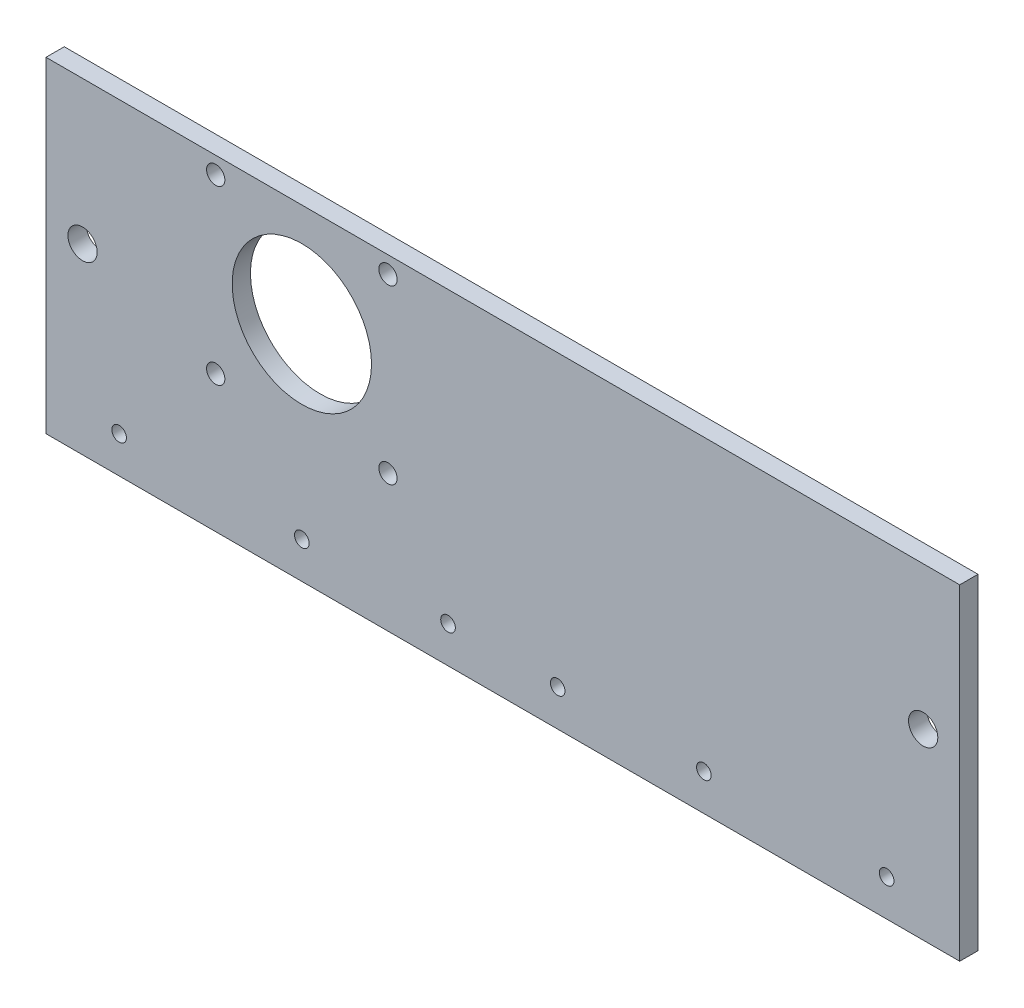
ISO-10303-21;
HEADER;
FILE_DESCRIPTION(('STEP AP214'),'2;1');
FILE_NAME('part.step','',(''),(''),'','','');
FILE_SCHEMA(('AUTOMOTIVE_DESIGN { 1 0 10303 214 1 1 1 1 }'));
ENDSEC;
DATA;
#1=APPLICATION_CONTEXT('core data for automotive mechanical design processes');
#2=APPLICATION_PROTOCOL_DEFINITION('international standard','automotive_design',2000,#1);
#3=PRODUCT_CONTEXT('',#1,'mechanical');
#4=PRODUCT('Part','Part','',(#3));
#5=PRODUCT_RELATED_PRODUCT_CATEGORY('part','',(#4));
#6=PRODUCT_DEFINITION_FORMATION('','',#4);
#7=PRODUCT_DEFINITION_CONTEXT('part definition',#1,'design');
#8=PRODUCT_DEFINITION('design','',#6,#7);
#9=PRODUCT_DEFINITION_SHAPE('','',#8);
#10=(LENGTH_UNIT() NAMED_UNIT(*) SI_UNIT(.MILLI.,.METRE.));
#11=(NAMED_UNIT(*) PLANE_ANGLE_UNIT() SI_UNIT($,.RADIAN.));
#12=(NAMED_UNIT(*) SI_UNIT($,.STERADIAN.) SOLID_ANGLE_UNIT());
#13=UNCERTAINTY_MEASURE_WITH_UNIT(LENGTH_MEASURE(1.E-05),#10,'distance_accuracy_value','');
#14=(GEOMETRIC_REPRESENTATION_CONTEXT(3) GLOBAL_UNCERTAINTY_ASSIGNED_CONTEXT((#13)) GLOBAL_UNIT_ASSIGNED_CONTEXT((#10,
#11,#12)) REPRESENTATION_CONTEXT('',''));
#15=CARTESIAN_POINT('',(0.,0.,0.));
#16=DIRECTION('',(0.,0.,1.));
#17=DIRECTION('',(1.,0.,0.));
#18=AXIS2_PLACEMENT_3D('',#15,#16,#17);
#19=CARTESIAN_POINT('',(0.,0.,5.));
#20=DIRECTION('',(1.,0.,0.));
#21=DIRECTION('',(0.,0.,-1.));
#22=AXIS2_PLACEMENT_3D('',#19,#20,#21);
#23=PLANE('',#22);
#24=DIRECTION('',(0.,-1.,0.));
#25=VECTOR('',#24,1.);
#26=CARTESIAN_POINT('',(0.,0.,0.));
#27=LINE('',#26,#25);
#28=CARTESIAN_POINT('',(0.,89.2,0.));
#29=VERTEX_POINT('',#28);
#30=CARTESIAN_POINT('',(0.,0.,0.));
#31=VERTEX_POINT('',#30);
#32=EDGE_CURVE('E99',#29,#31,#27,.T.);
#33=ORIENTED_EDGE('',*,*,#32,.T.);
#34=DIRECTION('',(0.,0.,-1.));
#35=VECTOR('',#34,1.);
#36=CARTESIAN_POINT('',(0.,0.,5.));
#37=LINE('',#36,#35);
#38=CARTESIAN_POINT('',(0.,0.,5.));
#39=VERTEX_POINT('',#38);
#40=EDGE_CURVE('E11',#39,#31,#37,.T.);
#41=ORIENTED_EDGE('',*,*,#40,.F.);
#42=DIRECTION('',(0.,-1.,0.));
#43=VECTOR('',#42,1.);
#44=CARTESIAN_POINT('',(0.,0.,5.));
#45=LINE('',#44,#43);
#46=CARTESIAN_POINT('',(0.,89.2,5.));
#47=VERTEX_POINT('',#46);
#48=EDGE_CURVE('E86',#47,#39,#45,.T.);
#49=ORIENTED_EDGE('',*,*,#48,.F.);
#50=DIRECTION('',(0.,0.,-1.));
#51=VECTOR('',#50,1.);
#52=CARTESIAN_POINT('',(0.,89.2,5.));
#53=LINE('',#52,#51);
#54=EDGE_CURVE('E95',#47,#29,#53,.T.);
#55=ORIENTED_EDGE('',*,*,#54,.T.);
#56=EDGE_LOOP('',(#33,#41,#49,#55));
#57=FACE_BOUND('',#56,.T.);
#58=ADVANCED_FACE('F33',(#57),#23,.F.);
#59=CARTESIAN_POINT('',(0.,0.,5.));
#60=DIRECTION('',(0.,1.,0.));
#61=DIRECTION('',(0.,0.,1.));
#62=AXIS2_PLACEMENT_3D('',#59,#60,#61);
#63=PLANE('',#62);
#64=DIRECTION('',(1.,0.,0.));
#65=VECTOR('',#64,1.);
#66=CARTESIAN_POINT('',(0.,0.,0.));
#67=LINE('',#66,#65);
#68=CARTESIAN_POINT('',(250.,0.,0.));
#69=VERTEX_POINT('',#68);
#70=EDGE_CURVE('E90',#31,#69,#67,.T.);
#71=ORIENTED_EDGE('',*,*,#70,.T.);
#72=DIRECTION('',(0.,0.,-1.));
#73=VECTOR('',#72,1.);
#74=CARTESIAN_POINT('',(250.,0.,5.));
#75=LINE('',#74,#73);
#76=CARTESIAN_POINT('',(250.,0.,5.));
#77=VERTEX_POINT('',#76);
#78=EDGE_CURVE('E42',#77,#69,#75,.T.);
#79=ORIENTED_EDGE('',*,*,#78,.F.);
#80=DIRECTION('',(1.,0.,0.));
#81=VECTOR('',#80,1.);
#82=CARTESIAN_POINT('',(0.,0.,5.));
#83=LINE('',#82,#81);
#84=EDGE_CURVE('E81',#39,#77,#83,.T.);
#85=ORIENTED_EDGE('',*,*,#84,.F.);
#86=ORIENTED_EDGE('',*,*,#40,.T.);
#87=EDGE_LOOP('',(#71,#79,#85,#86));
#88=FACE_BOUND('',#87,.T.);
#89=ADVANCED_FACE('F89',(#88),#63,.F.);
#90=CARTESIAN_POINT('',(250.,0.,5.));
#91=DIRECTION('',(-1.,0.,0.));
#92=DIRECTION('',(0.,0.,1.));
#93=AXIS2_PLACEMENT_3D('',#90,#91,#92);
#94=PLANE('',#93);
#95=DIRECTION('',(0.,1.,0.));
#96=VECTOR('',#95,1.);
#97=CARTESIAN_POINT('',(250.,0.,0.));
#98=LINE('',#97,#96);
#99=CARTESIAN_POINT('',(250.,89.2,0.));
#100=VERTEX_POINT('',#99);
#101=EDGE_CURVE('E68',#69,#100,#98,.T.);
#102=ORIENTED_EDGE('',*,*,#101,.T.);
#103=DIRECTION('',(0.,0.,-1.));
#104=VECTOR('',#103,1.);
#105=CARTESIAN_POINT('',(250.,89.2,5.));
#106=LINE('',#105,#104);
#107=CARTESIAN_POINT('',(250.,89.2,5.));
#108=VERTEX_POINT('',#107);
#109=EDGE_CURVE('E91',#108,#100,#106,.T.);
#110=ORIENTED_EDGE('',*,*,#109,.F.);
#111=DIRECTION('',(0.,1.,0.));
#112=VECTOR('',#111,1.);
#113=CARTESIAN_POINT('',(250.,0.,5.));
#114=LINE('',#113,#112);
#115=EDGE_CURVE('E84',#77,#108,#114,.T.);
#116=ORIENTED_EDGE('',*,*,#115,.F.);
#117=ORIENTED_EDGE('',*,*,#78,.T.);
#118=EDGE_LOOP('',(#102,#110,#116,#117));
#119=FACE_BOUND('',#118,.T.);
#120=ADVANCED_FACE('F93',(#119),#94,.F.);
#121=CARTESIAN_POINT('',(0.,89.2,5.));
#122=DIRECTION('',(0.,-1.,0.));
#123=DIRECTION('',(0.,0.,-1.));
#124=AXIS2_PLACEMENT_3D('',#121,#122,#123);
#125=PLANE('',#124);
#126=DIRECTION('',(-1.,0.,0.));
#127=VECTOR('',#126,1.);
#128=CARTESIAN_POINT('',(0.,89.2,0.));
#129=LINE('',#128,#127);
#130=EDGE_CURVE('E74',#100,#29,#129,.T.);
#131=ORIENTED_EDGE('',*,*,#130,.T.);
#132=ORIENTED_EDGE('',*,*,#54,.F.);
#133=DIRECTION('',(-1.,0.,0.));
#134=VECTOR('',#133,1.);
#135=CARTESIAN_POINT('',(0.,89.2,5.));
#136=LINE('',#135,#134);
#137=EDGE_CURVE('E51',#108,#47,#136,.T.);
#138=ORIENTED_EDGE('',*,*,#137,.F.);
#139=ORIENTED_EDGE('',*,*,#109,.T.);
#140=EDGE_LOOP('',(#131,#132,#138,#139));
#141=FACE_BOUND('',#140,.T.);
#142=ADVANCED_FACE('F190',(#141),#125,.F.);
#143=CARTESIAN_POINT('',(0.,0.,5.));
#144=DIRECTION('',(0.,0.,-1.));
#145=DIRECTION('',(-1.,0.,0.));
#146=AXIS2_PLACEMENT_3D('',#143,#144,#145);
#147=PLANE('',#146);
#148=CARTESIAN_POINT('',(70.,61.,5.));
#149=DIRECTION('',(0.,0.,1.));
#150=DIRECTION('',(1.,0.,0.));
#151=AXIS2_PLACEMENT_3D('',#148,#149,#150);
#152=CIRCLE('',#151,19.0625);
#153=CARTESIAN_POINT('',(89.0625,61.,5.));
#154=VERTEX_POINT('',#153);
#155=EDGE_CURVE('E162',#154,#154,#152,.T.);
#156=ORIENTED_EDGE('',*,*,#155,.F.);
#157=EDGE_LOOP('',(#156));
#158=FACE_BOUND('',#157,.T.);
#159=CARTESIAN_POINT('',(93.57,37.43,5.));
#160=DIRECTION('',(0.,0.,1.));
#161=DIRECTION('',(1.,0.,0.));
#162=AXIS2_PLACEMENT_3D('',#159,#160,#161);
#163=CIRCLE('',#162,2.5);
#164=CARTESIAN_POINT('',(96.07,37.43,5.));
#165=VERTEX_POINT('',#164);
#166=EDGE_CURVE('E152',#165,#165,#163,.T.);
#167=ORIENTED_EDGE('',*,*,#166,.F.);
#168=EDGE_LOOP('',(#167));
#169=FACE_BOUND('',#168,.T.);
#170=CARTESIAN_POINT('',(46.43,37.43,5.));
#171=DIRECTION('',(0.,0.,1.));
#172=DIRECTION('',(1.,0.,0.));
#173=AXIS2_PLACEMENT_3D('',#170,#171,#172);
#174=CIRCLE('',#173,2.5);
#175=CARTESIAN_POINT('',(48.93,37.43,5.));
#176=VERTEX_POINT('',#175);
#177=EDGE_CURVE('E149',#176,#176,#174,.T.);
#178=ORIENTED_EDGE('',*,*,#177,.F.);
#179=EDGE_LOOP('',(#178));
#180=FACE_BOUND('',#179,.T.);
#181=CARTESIAN_POINT('',(46.43,84.57,5.));
#182=DIRECTION('',(0.,0.,1.));
#183=DIRECTION('',(1.,0.,0.));
#184=AXIS2_PLACEMENT_3D('',#181,#182,#183);
#185=CIRCLE('',#184,2.5);
#186=CARTESIAN_POINT('',(48.93,84.57,5.));
#187=VERTEX_POINT('',#186);
#188=EDGE_CURVE('E146',#187,#187,#185,.T.);
#189=ORIENTED_EDGE('',*,*,#188,.F.);
#190=EDGE_LOOP('',(#189));
#191=FACE_BOUND('',#190,.T.);
#192=CARTESIAN_POINT('',(93.57,84.57,5.));
#193=DIRECTION('',(0.,0.,1.));
#194=DIRECTION('',(1.,0.,0.));
#195=AXIS2_PLACEMENT_3D('',#192,#193,#194);
#196=CIRCLE('',#195,2.5);
#197=CARTESIAN_POINT('',(96.07,84.57,5.));
#198=VERTEX_POINT('',#197);
#199=EDGE_CURVE('E142',#198,#198,#196,.T.);
#200=ORIENTED_EDGE('',*,*,#199,.F.);
#201=EDGE_LOOP('',(#200));
#202=FACE_BOUND('',#201,.T.);
#203=CARTESIAN_POINT('',(10.,50.,5.));
#204=DIRECTION('',(0.,0.,1.));
#205=DIRECTION('',(1.,0.,0.));
#206=AXIS2_PLACEMENT_3D('',#203,#204,#205);
#207=CIRCLE('',#206,4.);
#208=CARTESIAN_POINT('',(14.,50.,5.));
#209=VERTEX_POINT('',#208);
#210=EDGE_CURVE('E138',#209,#209,#207,.T.);
#211=ORIENTED_EDGE('',*,*,#210,.F.);
#212=EDGE_LOOP('',(#211));
#213=FACE_BOUND('',#212,.T.);
#214=CARTESIAN_POINT('',(240.,50.,5.));
#215=DIRECTION('',(0.,0.,1.));
#216=DIRECTION('',(1.,0.,0.));
#217=AXIS2_PLACEMENT_3D('',#214,#215,#216);
#218=CIRCLE('',#217,3.99999999999999);
#219=CARTESIAN_POINT('',(244.,50.,5.));
#220=VERTEX_POINT('',#219);
#221=EDGE_CURVE('E134',#220,#220,#218,.T.);
#222=ORIENTED_EDGE('',*,*,#221,.F.);
#223=EDGE_LOOP('',(#222));
#224=FACE_BOUND('',#223,.T.);
#225=CARTESIAN_POINT('',(230.,10.,5.));
#226=DIRECTION('',(0.,0.,1.));
#227=DIRECTION('',(1.,0.,0.));
#228=AXIS2_PLACEMENT_3D('',#225,#226,#227);
#229=CIRCLE('',#228,2.);
#230=CARTESIAN_POINT('',(232.,10.,5.));
#231=VERTEX_POINT('',#230);
#232=EDGE_CURVE('E130',#231,#231,#229,.T.);
#233=ORIENTED_EDGE('',*,*,#232,.F.);
#234=EDGE_LOOP('',(#233));
#235=FACE_BOUND('',#234,.T.);
#236=CARTESIAN_POINT('',(180.,10.,5.));
#237=DIRECTION('',(0.,0.,1.));
#238=DIRECTION('',(1.,0.,0.));
#239=AXIS2_PLACEMENT_3D('',#236,#237,#238);
#240=CIRCLE('',#239,2.);
#241=CARTESIAN_POINT('',(182.,10.,5.));
#242=VERTEX_POINT('',#241);
#243=EDGE_CURVE('E126',#242,#242,#240,.T.);
#244=ORIENTED_EDGE('',*,*,#243,.F.);
#245=EDGE_LOOP('',(#244));
#246=FACE_BOUND('',#245,.T.);
#247=CARTESIAN_POINT('',(140.,10.,5.));
#248=DIRECTION('',(0.,0.,1.));
#249=DIRECTION('',(1.,0.,0.));
#250=AXIS2_PLACEMENT_3D('',#247,#248,#249);
#251=CIRCLE('',#250,2.);
#252=CARTESIAN_POINT('',(142.,10.,5.));
#253=VERTEX_POINT('',#252);
#254=EDGE_CURVE('E122',#253,#253,#251,.T.);
#255=ORIENTED_EDGE('',*,*,#254,.F.);
#256=EDGE_LOOP('',(#255));
#257=FACE_BOUND('',#256,.T.);
#258=CARTESIAN_POINT('',(110.,9.99999999999999,5.));
#259=DIRECTION('',(0.,0.,1.));
#260=DIRECTION('',(1.,0.,0.));
#261=AXIS2_PLACEMENT_3D('',#258,#259,#260);
#262=CIRCLE('',#261,2.);
#263=CARTESIAN_POINT('',(112.,9.99999999999999,5.));
#264=VERTEX_POINT('',#263);
#265=EDGE_CURVE('E118',#264,#264,#262,.T.);
#266=ORIENTED_EDGE('',*,*,#265,.F.);
#267=EDGE_LOOP('',(#266));
#268=FACE_BOUND('',#267,.T.);
#269=CARTESIAN_POINT('',(70.,9.99999999999999,5.));
#270=DIRECTION('',(0.,0.,1.));
#271=DIRECTION('',(1.,0.,0.));
#272=AXIS2_PLACEMENT_3D('',#269,#270,#271);
#273=CIRCLE('',#272,2.);
#274=CARTESIAN_POINT('',(72.,9.99999999999999,5.));
#275=VERTEX_POINT('',#274);
#276=EDGE_CURVE('E114',#275,#275,#273,.T.);
#277=ORIENTED_EDGE('',*,*,#276,.F.);
#278=EDGE_LOOP('',(#277));
#279=FACE_BOUND('',#278,.T.);
#280=CARTESIAN_POINT('',(20.,10.,5.));
#281=DIRECTION('',(0.,0.,1.));
#282=DIRECTION('',(1.,0.,0.));
#283=AXIS2_PLACEMENT_3D('',#280,#281,#282);
#284=CIRCLE('',#283,2.);
#285=CARTESIAN_POINT('',(22.,10.,5.));
#286=VERTEX_POINT('',#285);
#287=EDGE_CURVE('E110',#286,#286,#284,.T.);
#288=ORIENTED_EDGE('',*,*,#287,.F.);
#289=EDGE_LOOP('',(#288));
#290=FACE_BOUND('',#289,.T.);
#291=ORIENTED_EDGE('',*,*,#48,.T.);
#292=ORIENTED_EDGE('',*,*,#84,.T.);
#293=ORIENTED_EDGE('',*,*,#115,.T.);
#294=ORIENTED_EDGE('',*,*,#137,.T.);
#295=EDGE_LOOP('',(#291,#292,#293,#294));
#296=FACE_BOUND('',#295,.T.);
#297=ADVANCED_FACE('F82',(#158,#169,#180,#191,#202,#213,#224,#235,#246,#257,#268,#279,#290,
#296),#147,.F.);
#298=CARTESIAN_POINT('',(0.,0.,0.));
#299=DIRECTION('',(0.,0.,-1.));
#300=DIRECTION('',(-1.,0.,0.));
#301=AXIS2_PLACEMENT_3D('',#298,#299,#300);
#302=PLANE('',#301);
#303=CARTESIAN_POINT('',(70.,61.,0.));
#304=DIRECTION('',(0.,0.,-1.));
#305=DIRECTION('',(-1.,0.,0.));
#306=AXIS2_PLACEMENT_3D('',#303,#304,#305);
#307=CIRCLE('',#306,19.0625);
#308=CARTESIAN_POINT('',(50.9375,61.,0.));
#309=VERTEX_POINT('',#308);
#310=EDGE_CURVE('E36',#309,#309,#307,.T.);
#311=ORIENTED_EDGE('',*,*,#310,.F.);
#312=EDGE_LOOP('',(#311));
#313=FACE_BOUND('',#312,.T.);
#314=CARTESIAN_POINT('',(93.57,37.43,0.));
#315=DIRECTION('',(0.,0.,-1.));
#316=DIRECTION('',(-1.,0.,0.));
#317=AXIS2_PLACEMENT_3D('',#314,#315,#316);
#318=CIRCLE('',#317,2.5);
#319=CARTESIAN_POINT('',(91.07,37.43,0.));
#320=VERTEX_POINT('',#319);
#321=EDGE_CURVE('E150',#320,#320,#318,.T.);
#322=ORIENTED_EDGE('',*,*,#321,.F.);
#323=EDGE_LOOP('',(#322));
#324=FACE_BOUND('',#323,.T.);
#325=CARTESIAN_POINT('',(46.43,37.43,0.));
#326=DIRECTION('',(0.,0.,-1.));
#327=DIRECTION('',(-1.,0.,0.));
#328=AXIS2_PLACEMENT_3D('',#325,#326,#327);
#329=CIRCLE('',#328,2.5);
#330=CARTESIAN_POINT('',(43.93,37.43,0.));
#331=VERTEX_POINT('',#330);
#332=EDGE_CURVE('E147',#331,#331,#329,.T.);
#333=ORIENTED_EDGE('',*,*,#332,.F.);
#334=EDGE_LOOP('',(#333));
#335=FACE_BOUND('',#334,.T.);
#336=CARTESIAN_POINT('',(46.43,84.57,0.));
#337=DIRECTION('',(0.,0.,-1.));
#338=DIRECTION('',(-1.,0.,0.));
#339=AXIS2_PLACEMENT_3D('',#336,#337,#338);
#340=CIRCLE('',#339,2.5);
#341=CARTESIAN_POINT('',(43.93,84.57,0.));
#342=VERTEX_POINT('',#341);
#343=EDGE_CURVE('E143',#342,#342,#340,.T.);
#344=ORIENTED_EDGE('',*,*,#343,.F.);
#345=EDGE_LOOP('',(#344));
#346=FACE_BOUND('',#345,.T.);
#347=CARTESIAN_POINT('',(93.57,84.57,0.));
#348=DIRECTION('',(0.,0.,-1.));
#349=DIRECTION('',(-1.,0.,0.));
#350=AXIS2_PLACEMENT_3D('',#347,#348,#349);
#351=CIRCLE('',#350,2.5);
#352=CARTESIAN_POINT('',(91.07,84.57,0.));
#353=VERTEX_POINT('',#352);
#354=EDGE_CURVE('E139',#353,#353,#351,.T.);
#355=ORIENTED_EDGE('',*,*,#354,.F.);
#356=EDGE_LOOP('',(#355));
#357=FACE_BOUND('',#356,.T.);
#358=CARTESIAN_POINT('',(10.,50.,0.));
#359=DIRECTION('',(0.,0.,-1.));
#360=DIRECTION('',(-1.,0.,0.));
#361=AXIS2_PLACEMENT_3D('',#358,#359,#360);
#362=CIRCLE('',#361,4.);
#363=CARTESIAN_POINT('',(6.,50.,0.));
#364=VERTEX_POINT('',#363);
#365=EDGE_CURVE('E135',#364,#364,#362,.T.);
#366=ORIENTED_EDGE('',*,*,#365,.F.);
#367=EDGE_LOOP('',(#366));
#368=FACE_BOUND('',#367,.T.);
#369=CARTESIAN_POINT('',(240.,50.,0.));
#370=DIRECTION('',(0.,0.,-1.));
#371=DIRECTION('',(-1.,0.,0.));
#372=AXIS2_PLACEMENT_3D('',#369,#370,#371);
#373=CIRCLE('',#372,3.99999999999999);
#374=CARTESIAN_POINT('',(236.,50.,0.));
#375=VERTEX_POINT('',#374);
#376=EDGE_CURVE('E131',#375,#375,#373,.T.);
#377=ORIENTED_EDGE('',*,*,#376,.F.);
#378=EDGE_LOOP('',(#377));
#379=FACE_BOUND('',#378,.T.);
#380=CARTESIAN_POINT('',(230.,10.,0.));
#381=DIRECTION('',(0.,0.,-1.));
#382=DIRECTION('',(-1.,0.,0.));
#383=AXIS2_PLACEMENT_3D('',#380,#381,#382);
#384=CIRCLE('',#383,2.);
#385=CARTESIAN_POINT('',(228.,10.,0.));
#386=VERTEX_POINT('',#385);
#387=EDGE_CURVE('E127',#386,#386,#384,.T.);
#388=ORIENTED_EDGE('',*,*,#387,.F.);
#389=EDGE_LOOP('',(#388));
#390=FACE_BOUND('',#389,.T.);
#391=CARTESIAN_POINT('',(180.,10.,0.));
#392=DIRECTION('',(0.,0.,-1.));
#393=DIRECTION('',(-1.,0.,0.));
#394=AXIS2_PLACEMENT_3D('',#391,#392,#393);
#395=CIRCLE('',#394,2.);
#396=CARTESIAN_POINT('',(178.,10.,0.));
#397=VERTEX_POINT('',#396);
#398=EDGE_CURVE('E123',#397,#397,#395,.T.);
#399=ORIENTED_EDGE('',*,*,#398,.F.);
#400=EDGE_LOOP('',(#399));
#401=FACE_BOUND('',#400,.T.);
#402=CARTESIAN_POINT('',(140.,10.,0.));
#403=DIRECTION('',(0.,0.,-1.));
#404=DIRECTION('',(-1.,0.,0.));
#405=AXIS2_PLACEMENT_3D('',#402,#403,#404);
#406=CIRCLE('',#405,2.);
#407=CARTESIAN_POINT('',(138.,10.,0.));
#408=VERTEX_POINT('',#407);
#409=EDGE_CURVE('E119',#408,#408,#406,.T.);
#410=ORIENTED_EDGE('',*,*,#409,.F.);
#411=EDGE_LOOP('',(#410));
#412=FACE_BOUND('',#411,.T.);
#413=CARTESIAN_POINT('',(110.,9.99999999999999,0.));
#414=DIRECTION('',(0.,0.,-1.));
#415=DIRECTION('',(-1.,0.,0.));
#416=AXIS2_PLACEMENT_3D('',#413,#414,#415);
#417=CIRCLE('',#416,2.);
#418=CARTESIAN_POINT('',(108.,9.99999999999999,0.));
#419=VERTEX_POINT('',#418);
#420=EDGE_CURVE('E115',#419,#419,#417,.T.);
#421=ORIENTED_EDGE('',*,*,#420,.F.);
#422=EDGE_LOOP('',(#421));
#423=FACE_BOUND('',#422,.T.);
#424=CARTESIAN_POINT('',(70.,9.99999999999999,0.));
#425=DIRECTION('',(0.,0.,-1.));
#426=DIRECTION('',(-1.,0.,0.));
#427=AXIS2_PLACEMENT_3D('',#424,#425,#426);
#428=CIRCLE('',#427,2.);
#429=CARTESIAN_POINT('',(68.,9.99999999999999,0.));
#430=VERTEX_POINT('',#429);
#431=EDGE_CURVE('E111',#430,#430,#428,.T.);
#432=ORIENTED_EDGE('',*,*,#431,.F.);
#433=EDGE_LOOP('',(#432));
#434=FACE_BOUND('',#433,.T.);
#435=CARTESIAN_POINT('',(20.,10.,0.));
#436=DIRECTION('',(0.,0.,-1.));
#437=DIRECTION('',(-1.,0.,0.));
#438=AXIS2_PLACEMENT_3D('',#435,#436,#437);
#439=CIRCLE('',#438,2.);
#440=CARTESIAN_POINT('',(18.,10.,0.));
#441=VERTEX_POINT('',#440);
#442=EDGE_CURVE('E102',#441,#441,#439,.T.);
#443=ORIENTED_EDGE('',*,*,#442,.F.);
#444=EDGE_LOOP('',(#443));
#445=FACE_BOUND('',#444,.T.);
#446=ORIENTED_EDGE('',*,*,#32,.F.);
#447=ORIENTED_EDGE('',*,*,#130,.F.);
#448=ORIENTED_EDGE('',*,*,#101,.F.);
#449=ORIENTED_EDGE('',*,*,#70,.F.);
#450=EDGE_LOOP('',(#446,#447,#448,#449));
#451=FACE_BOUND('',#450,.T.);
#452=ADVANCED_FACE('F189',(#313,#324,#335,#346,#357,#368,#379,#390,#401,#412,#423,#434,#445,
#451),#302,.T.);
#453=CARTESIAN_POINT('',(20.,10.,-22.));
#454=DIRECTION('',(0.,0.,1.));
#455=DIRECTION('',(1.,0.,0.));
#456=AXIS2_PLACEMENT_3D('',#453,#454,#455);
#457=CYLINDRICAL_SURFACE('',#456,2.);
#458=ORIENTED_EDGE('',*,*,#442,.T.);
#459=EDGE_LOOP('',(#458));
#460=FACE_BOUND('',#459,.T.);
#461=ORIENTED_EDGE('',*,*,#287,.T.);
#462=EDGE_LOOP('',(#461));
#463=FACE_BOUND('',#462,.T.);
#464=ADVANCED_FACE('F186',(#460,#463),#457,.F.);
#465=CARTESIAN_POINT('',(70.,9.99999999999999,-22.));
#466=DIRECTION('',(0.,0.,1.));
#467=DIRECTION('',(1.,0.,0.));
#468=AXIS2_PLACEMENT_3D('',#465,#466,#467);
#469=CYLINDRICAL_SURFACE('',#468,2.);
#470=ORIENTED_EDGE('',*,*,#431,.T.);
#471=EDGE_LOOP('',(#470));
#472=FACE_BOUND('',#471,.T.);
#473=ORIENTED_EDGE('',*,*,#276,.T.);
#474=EDGE_LOOP('',(#473));
#475=FACE_BOUND('',#474,.T.);
#476=ADVANCED_FACE('F230',(#472,#475),#469,.F.);
#477=CARTESIAN_POINT('',(110.,9.99999999999999,-22.));
#478=DIRECTION('',(0.,0.,1.));
#479=DIRECTION('',(1.,0.,0.));
#480=AXIS2_PLACEMENT_3D('',#477,#478,#479);
#481=CYLINDRICAL_SURFACE('',#480,2.);
#482=ORIENTED_EDGE('',*,*,#420,.T.);
#483=EDGE_LOOP('',(#482));
#484=FACE_BOUND('',#483,.T.);
#485=ORIENTED_EDGE('',*,*,#265,.T.);
#486=EDGE_LOOP('',(#485));
#487=FACE_BOUND('',#486,.T.);
#488=ADVANCED_FACE('F240',(#484,#487),#481,.F.);
#489=CARTESIAN_POINT('',(140.,10.,-22.));
#490=DIRECTION('',(0.,0.,1.));
#491=DIRECTION('',(1.,0.,0.));
#492=AXIS2_PLACEMENT_3D('',#489,#490,#491);
#493=CYLINDRICAL_SURFACE('',#492,2.);
#494=ORIENTED_EDGE('',*,*,#409,.T.);
#495=EDGE_LOOP('',(#494));
#496=FACE_BOUND('',#495,.T.);
#497=ORIENTED_EDGE('',*,*,#254,.T.);
#498=EDGE_LOOP('',(#497));
#499=FACE_BOUND('',#498,.T.);
#500=ADVANCED_FACE('F250',(#496,#499),#493,.F.);
#501=CARTESIAN_POINT('',(180.,10.,-22.));
#502=DIRECTION('',(0.,0.,1.));
#503=DIRECTION('',(1.,0.,0.));
#504=AXIS2_PLACEMENT_3D('',#501,#502,#503);
#505=CYLINDRICAL_SURFACE('',#504,2.);
#506=ORIENTED_EDGE('',*,*,#398,.T.);
#507=EDGE_LOOP('',(#506));
#508=FACE_BOUND('',#507,.T.);
#509=ORIENTED_EDGE('',*,*,#243,.T.);
#510=EDGE_LOOP('',(#509));
#511=FACE_BOUND('',#510,.T.);
#512=ADVANCED_FACE('F260',(#508,#511),#505,.F.);
#513=CARTESIAN_POINT('',(230.,10.,-22.));
#514=DIRECTION('',(0.,0.,1.));
#515=DIRECTION('',(1.,0.,0.));
#516=AXIS2_PLACEMENT_3D('',#513,#514,#515);
#517=CYLINDRICAL_SURFACE('',#516,2.);
#518=ORIENTED_EDGE('',*,*,#387,.T.);
#519=EDGE_LOOP('',(#518));
#520=FACE_BOUND('',#519,.T.);
#521=ORIENTED_EDGE('',*,*,#232,.T.);
#522=EDGE_LOOP('',(#521));
#523=FACE_BOUND('',#522,.T.);
#524=ADVANCED_FACE('F270',(#520,#523),#517,.F.);
#525=CARTESIAN_POINT('',(240.,50.,-22.));
#526=DIRECTION('',(0.,0.,1.));
#527=DIRECTION('',(1.,0.,0.));
#528=AXIS2_PLACEMENT_3D('',#525,#526,#527);
#529=CYLINDRICAL_SURFACE('',#528,3.99999999999999);
#530=ORIENTED_EDGE('',*,*,#376,.T.);
#531=EDGE_LOOP('',(#530));
#532=FACE_BOUND('',#531,.T.);
#533=ORIENTED_EDGE('',*,*,#221,.T.);
#534=EDGE_LOOP('',(#533));
#535=FACE_BOUND('',#534,.T.);
#536=ADVANCED_FACE('F280',(#532,#535),#529,.F.);
#537=CARTESIAN_POINT('',(10.,50.,-22.));
#538=DIRECTION('',(0.,0.,1.));
#539=DIRECTION('',(1.,0.,0.));
#540=AXIS2_PLACEMENT_3D('',#537,#538,#539);
#541=CYLINDRICAL_SURFACE('',#540,4.);
#542=ORIENTED_EDGE('',*,*,#365,.T.);
#543=EDGE_LOOP('',(#542));
#544=FACE_BOUND('',#543,.T.);
#545=ORIENTED_EDGE('',*,*,#210,.T.);
#546=EDGE_LOOP('',(#545));
#547=FACE_BOUND('',#546,.T.);
#548=ADVANCED_FACE('F290',(#544,#547),#541,.F.);
#549=CARTESIAN_POINT('',(93.57,84.57,-22.));
#550=DIRECTION('',(0.,0.,1.));
#551=DIRECTION('',(1.,0.,0.));
#552=AXIS2_PLACEMENT_3D('',#549,#550,#551);
#553=CYLINDRICAL_SURFACE('',#552,2.5);
#554=ORIENTED_EDGE('',*,*,#354,.T.);
#555=EDGE_LOOP('',(#554));
#556=FACE_BOUND('',#555,.T.);
#557=ORIENTED_EDGE('',*,*,#199,.T.);
#558=EDGE_LOOP('',(#557));
#559=FACE_BOUND('',#558,.T.);
#560=ADVANCED_FACE('F300',(#556,#559),#553,.F.);
#561=CARTESIAN_POINT('',(46.43,84.57,-22.));
#562=DIRECTION('',(0.,0.,1.));
#563=DIRECTION('',(1.,0.,0.));
#564=AXIS2_PLACEMENT_3D('',#561,#562,#563);
#565=CYLINDRICAL_SURFACE('',#564,2.5);
#566=ORIENTED_EDGE('',*,*,#343,.T.);
#567=EDGE_LOOP('',(#566));
#568=FACE_BOUND('',#567,.T.);
#569=ORIENTED_EDGE('',*,*,#188,.T.);
#570=EDGE_LOOP('',(#569));
#571=FACE_BOUND('',#570,.T.);
#572=ADVANCED_FACE('F310',(#568,#571),#565,.F.);
#573=CARTESIAN_POINT('',(46.43,37.43,-22.));
#574=DIRECTION('',(0.,0.,1.));
#575=DIRECTION('',(1.,0.,0.));
#576=AXIS2_PLACEMENT_3D('',#573,#574,#575);
#577=CYLINDRICAL_SURFACE('',#576,2.5);
#578=ORIENTED_EDGE('',*,*,#332,.T.);
#579=EDGE_LOOP('',(#578));
#580=FACE_BOUND('',#579,.T.);
#581=ORIENTED_EDGE('',*,*,#177,.T.);
#582=EDGE_LOOP('',(#581));
#583=FACE_BOUND('',#582,.T.);
#584=ADVANCED_FACE('F320',(#580,#583),#577,.F.);
#585=CARTESIAN_POINT('',(93.57,37.43,-22.));
#586=DIRECTION('',(0.,0.,1.));
#587=DIRECTION('',(1.,0.,0.));
#588=AXIS2_PLACEMENT_3D('',#585,#586,#587);
#589=CYLINDRICAL_SURFACE('',#588,2.5);
#590=ORIENTED_EDGE('',*,*,#321,.T.);
#591=EDGE_LOOP('',(#590));
#592=FACE_BOUND('',#591,.T.);
#593=ORIENTED_EDGE('',*,*,#166,.T.);
#594=EDGE_LOOP('',(#593));
#595=FACE_BOUND('',#594,.T.);
#596=ADVANCED_FACE('F330',(#592,#595),#589,.F.);
#597=CARTESIAN_POINT('',(70.,61.,-22.));
#598=DIRECTION('',(0.,0.,1.));
#599=DIRECTION('',(1.,0.,0.));
#600=AXIS2_PLACEMENT_3D('',#597,#598,#599);
#601=CYLINDRICAL_SURFACE('',#600,19.0625);
#602=ORIENTED_EDGE('',*,*,#310,.T.);
#603=EDGE_LOOP('',(#602));
#604=FACE_BOUND('',#603,.T.);
#605=ORIENTED_EDGE('',*,*,#155,.T.);
#606=EDGE_LOOP('',(#605));
#607=FACE_BOUND('',#606,.T.);
#608=ADVANCED_FACE('F339',(#604,#607),#601,.F.);
#609=CLOSED_SHELL('',(#58,#89,#120,#142,#297,#452,#464,#476,#488,#500,#512,#524,#536,#548,#560,
#572,#584,#596,#608));
#610=MANIFOLD_SOLID_BREP('B2',#609);
#611=ADVANCED_BREP_SHAPE_REPRESENTATION('',(#18,#610),#14);
#612=SHAPE_DEFINITION_REPRESENTATION(#9,#611);
ENDSEC;
END-ISO-10303-21;
